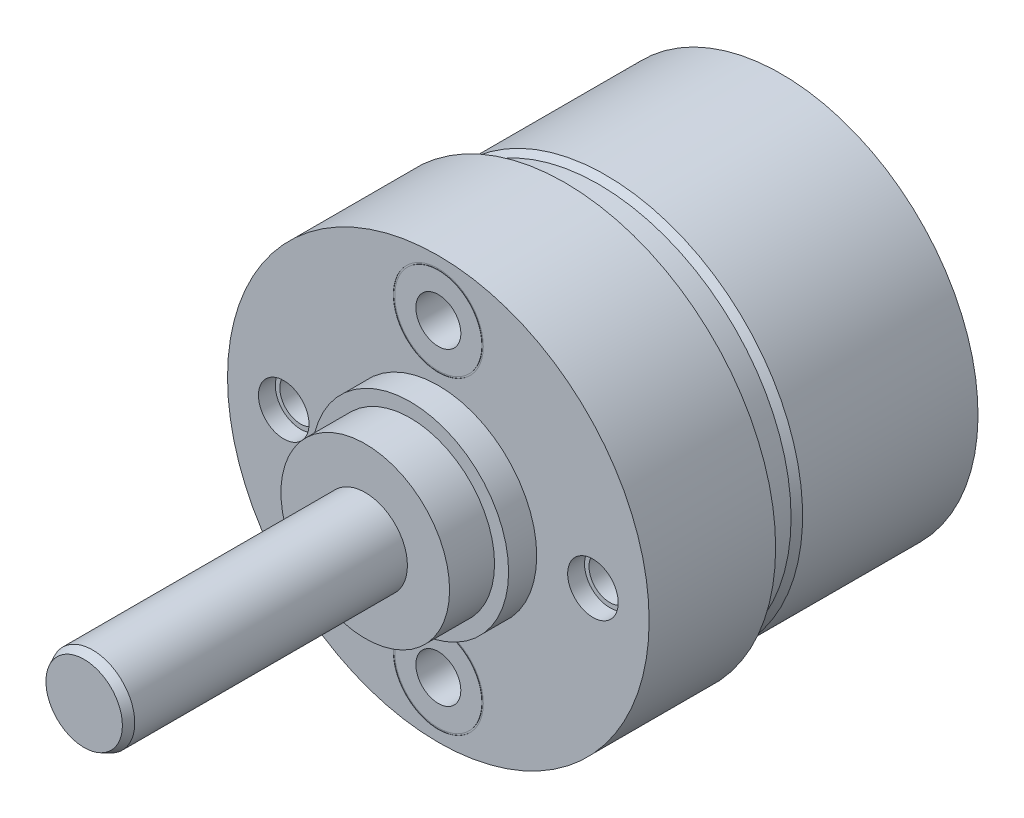
ISO-10303-21;
HEADER;
FILE_DESCRIPTION(('STEP AP214'),'2;1');
FILE_NAME('part.step','',(''),(''),'','','');
FILE_SCHEMA(('AUTOMOTIVE_DESIGN { 1 0 10303 214 1 1 1 1 }'));
ENDSEC;
DATA;
#1=APPLICATION_CONTEXT('core data for automotive mechanical design processes');
#2=APPLICATION_PROTOCOL_DEFINITION('international standard','automotive_design',2000,#1);
#3=PRODUCT_CONTEXT('',#1,'mechanical');
#4=PRODUCT('Part','Part','',(#3));
#5=PRODUCT_RELATED_PRODUCT_CATEGORY('part','',(#4));
#6=PRODUCT_DEFINITION_FORMATION('','',#4);
#7=PRODUCT_DEFINITION_CONTEXT('part definition',#1,'design');
#8=PRODUCT_DEFINITION('design','',#6,#7);
#9=PRODUCT_DEFINITION_SHAPE('','',#8);
#10=(LENGTH_UNIT() NAMED_UNIT(*) SI_UNIT(.MILLI.,.METRE.));
#11=(NAMED_UNIT(*) PLANE_ANGLE_UNIT() SI_UNIT($,.RADIAN.));
#12=(NAMED_UNIT(*) SI_UNIT($,.STERADIAN.) SOLID_ANGLE_UNIT());
#13=UNCERTAINTY_MEASURE_WITH_UNIT(LENGTH_MEASURE(1.E-05),#10,'distance_accuracy_value','');
#14=(GEOMETRIC_REPRESENTATION_CONTEXT(3) GLOBAL_UNCERTAINTY_ASSIGNED_CONTEXT((#13)) GLOBAL_UNIT_ASSIGNED_CONTEXT((#10,
#11,#12)) REPRESENTATION_CONTEXT('',''));
#15=CARTESIAN_POINT('',(0.,0.,0.));
#16=DIRECTION('',(0.,0.,1.));
#17=DIRECTION('',(1.,0.,0.));
#18=AXIS2_PLACEMENT_3D('',#15,#16,#17);
#19=CARTESIAN_POINT('',(0.,0.,-11.95));
#20=DIRECTION('',(0.,0.,1.));
#21=DIRECTION('',(1.,0.,0.));
#22=AXIS2_PLACEMENT_3D('',#19,#20,#21);
#23=PLANE('',#22);
#24=CARTESIAN_POINT('',(0.,0.,-11.95));
#25=DIRECTION('',(0.,0.,-1.));
#26=DIRECTION('',(1.,0.,0.));
#27=AXIS2_PLACEMENT_3D('',#24,#25,#26);
#28=CIRCLE('',#27,2.824);
#29=CARTESIAN_POINT('',(2.824,0.,-11.95));
#30=VERTEX_POINT('',#29);
#31=EDGE_CURVE('E180',#30,#30,#28,.T.);
#32=ORIENTED_EDGE('',*,*,#31,.T.);
#33=EDGE_LOOP('',(#32));
#34=FACE_BOUND('',#33,.T.);
#35=CARTESIAN_POINT('',(0.,0.,-11.95));
#36=DIRECTION('',(0.,0.,1.));
#37=DIRECTION('',(1.,0.,0.));
#38=AXIS2_PLACEMENT_3D('',#35,#36,#37);
#39=CIRCLE('',#38,2.724);
#40=CARTESIAN_POINT('',(2.724,0.,-11.95));
#41=VERTEX_POINT('',#40);
#42=EDGE_CURVE('E11',#41,#41,#39,.T.);
#43=ORIENTED_EDGE('',*,*,#42,.T.);
#44=EDGE_LOOP('',(#43));
#45=FACE_BOUND('',#44,.T.);
#46=ADVANCED_FACE('F16',(#34,#45),#23,.F.);
#47=CARTESIAN_POINT('',(0.,0.,-12.2));
#48=DIRECTION('',(0.,0.,1.));
#49=DIRECTION('',(1.,0.,0.));
#50=AXIS2_PLACEMENT_3D('',#47,#48,#49);
#51=CYLINDRICAL_SURFACE('',#50,2.724);
#52=ORIENTED_EDGE('',*,*,#42,.F.);
#53=EDGE_LOOP('',(#52));
#54=FACE_BOUND('',#53,.T.);
#55=CARTESIAN_POINT('',(0.,0.,-7.5));
#56=DIRECTION('',(0.,0.,1.));
#57=DIRECTION('',(1.,0.,0.));
#58=AXIS2_PLACEMENT_3D('',#55,#56,#57);
#59=CIRCLE('',#58,2.724);
#60=CARTESIAN_POINT('',(2.724,0.,-7.5));
#61=VERTEX_POINT('',#60);
#62=EDGE_CURVE('E27',#61,#61,#59,.T.);
#63=ORIENTED_EDGE('',*,*,#62,.T.);
#64=EDGE_LOOP('',(#63));
#65=FACE_BOUND('',#64,.T.);
#66=ADVANCED_FACE('F323',(#54,#65),#51,.F.);
#67=CARTESIAN_POINT('',(0.,0.,-7.5));
#68=DIRECTION('',(0.,0.,1.));
#69=DIRECTION('',(1.,0.,0.));
#70=AXIS2_PLACEMENT_3D('',#67,#68,#69);
#71=PLANE('',#70);
#72=ORIENTED_EDGE('',*,*,#62,.F.);
#73=EDGE_LOOP('',(#72));
#74=FACE_BOUND('',#73,.T.);
#75=ADVANCED_FACE('F328',(#74),#71,.F.);
#76=CARTESIAN_POINT('',(0.,0.,-12.15));
#77=DIRECTION('',(0.,0.,-1.));
#78=DIRECTION('',(0.,-1.,0.));
#79=AXIS2_PLACEMENT_3D('',#76,#77,#78);
#80=PLANE('',#79);
#81=CARTESIAN_POINT('',(0.,0.,-12.15));
#82=DIRECTION('',(0.,0.,-1.));
#83=DIRECTION('',(1.,0.,0.));
#84=AXIS2_PLACEMENT_3D('',#81,#82,#83);
#85=CIRCLE('',#84,2.824);
#86=CARTESIAN_POINT('',(2.824,0.,-12.15));
#87=VERTEX_POINT('',#86);
#88=EDGE_CURVE('E176',#87,#87,#85,.T.);
#89=ORIENTED_EDGE('',*,*,#88,.F.);
#90=EDGE_LOOP('',(#89));
#91=FACE_BOUND('',#90,.T.);
#92=CARTESIAN_POINT('',(0.,0.,-12.15));
#93=DIRECTION('',(0.,0.,-1.));
#94=DIRECTION('',(1.,0.,0.));
#95=AXIS2_PLACEMENT_3D('',#92,#93,#94);
#96=CIRCLE('',#95,6.);
#97=CARTESIAN_POINT('',(6.,0.,-12.15));
#98=VERTEX_POINT('',#97);
#99=EDGE_CURVE('E181',#98,#98,#96,.T.);
#100=ORIENTED_EDGE('',*,*,#99,.T.);
#101=EDGE_LOOP('',(#100));
#102=FACE_BOUND('',#101,.T.);
#103=ADVANCED_FACE('F375',(#91,#102),#80,.T.);
#104=CARTESIAN_POINT('',(0.,0.,-12.15));
#105=DIRECTION('',(0.,0.,1.));
#106=DIRECTION('',(1.,0.,0.));
#107=AXIS2_PLACEMENT_3D('',#104,#105,#106);
#108=CYLINDRICAL_SURFACE('',#107,2.824);
#109=ORIENTED_EDGE('',*,*,#31,.F.);
#110=EDGE_LOOP('',(#109));
#111=FACE_BOUND('',#110,.T.);
#112=ORIENTED_EDGE('',*,*,#88,.T.);
#113=EDGE_LOOP('',(#112));
#114=FACE_BOUND('',#113,.T.);
#115=ADVANCED_FACE('F177',(#111,#114),#108,.F.);
#116=CARTESIAN_POINT('',(0.,0.,-12.15));
#117=DIRECTION('',(0.,0.,1.));
#118=DIRECTION('',(1.,0.,0.));
#119=AXIS2_PLACEMENT_3D('',#116,#117,#118);
#120=CYLINDRICAL_SURFACE('',#119,6.);
#121=CARTESIAN_POINT('',(0.,0.,-11.95));
#122=DIRECTION('',(0.,0.,-1.));
#123=DIRECTION('',(1.,0.,0.));
#124=AXIS2_PLACEMENT_3D('',#121,#122,#123);
#125=CIRCLE('',#124,6.);
#126=CARTESIAN_POINT('',(6.,0.,-11.95));
#127=VERTEX_POINT('',#126);
#128=EDGE_CURVE('E221',#127,#127,#125,.T.);
#129=ORIENTED_EDGE('',*,*,#128,.T.);
#130=EDGE_LOOP('',(#129));
#131=FACE_BOUND('',#130,.T.);
#132=ORIENTED_EDGE('',*,*,#99,.F.);
#133=EDGE_LOOP('',(#132));
#134=FACE_BOUND('',#133,.T.);
#135=ADVANCED_FACE('F396',(#131,#134),#120,.T.);
#136=CARTESIAN_POINT('',(0.,0.,-12.2));
#137=DIRECTION('',(0.,0.,1.));
#138=DIRECTION('',(1.,0.,0.));
#139=AXIS2_PLACEMENT_3D('',#136,#137,#138);
#140=CYLINDRICAL_SURFACE('',#139,6.4);
#141=CARTESIAN_POINT('',(0.,0.,-12.2));
#142=DIRECTION('',(0.,0.,1.));
#143=DIRECTION('',(1.,0.,0.));
#144=AXIS2_PLACEMENT_3D('',#141,#142,#143);
#145=CIRCLE('',#144,6.4);
#146=CARTESIAN_POINT('',(-6.24829444556757,-1.38521352920386,-12.2));
#147=VERTEX_POINT('',#146);
#148=EDGE_CURVE('E234',#147,#147,#145,.T.);
#149=ORIENTED_EDGE('',*,*,#148,.F.);
#150=EDGE_LOOP('',(#149));
#151=FACE_BOUND('',#150,.T.);
#152=CARTESIAN_POINT('',(0.,0.,-11.95));
#153=DIRECTION('',(0.,0.,1.));
#154=DIRECTION('',(1.,0.,0.));
#155=AXIS2_PLACEMENT_3D('',#152,#153,#154);
#156=CIRCLE('',#155,6.4);
#157=CARTESIAN_POINT('',(6.4,0.,-11.95));
#158=VERTEX_POINT('',#157);
#159=EDGE_CURVE('E189',#158,#158,#156,.T.);
#160=ORIENTED_EDGE('',*,*,#159,.T.);
#161=EDGE_LOOP('',(#160));
#162=FACE_BOUND('',#161,.T.);
#163=ADVANCED_FACE('F392',(#151,#162),#140,.F.);
#164=CARTESIAN_POINT('',(0.,0.,-11.95));
#165=DIRECTION('',(0.,0.,1.));
#166=DIRECTION('',(1.,0.,0.));
#167=AXIS2_PLACEMENT_3D('',#164,#165,#166);
#168=PLANE('',#167);
#169=ORIENTED_EDGE('',*,*,#159,.F.);
#170=EDGE_LOOP('',(#169));
#171=FACE_BOUND('',#170,.T.);
#172=ORIENTED_EDGE('',*,*,#128,.F.);
#173=EDGE_LOOP('',(#172));
#174=FACE_BOUND('',#173,.T.);
#175=ADVANCED_FACE('F395',(#171,#174),#168,.F.);
#176=CARTESIAN_POINT('',(0.,0.,0.));
#177=DIRECTION('',(0.,0.,-1.));
#178=DIRECTION('',(-1.,0.,0.));
#179=AXIS2_PLACEMENT_3D('',#176,#177,#178);
#180=CYLINDRICAL_SURFACE('',#179,7.);
#181=CARTESIAN_POINT('',(0.,0.,-5.95980762113533));
#182=DIRECTION('',(0.,0.,-1.));
#183=DIRECTION('',(-1.,0.,0.));
#184=AXIS2_PLACEMENT_3D('',#181,#182,#183);
#185=CIRCLE('',#184,7.);
#186=CARTESIAN_POINT('',(-7.,0.,-5.95980762113533));
#187=VERTEX_POINT('',#186);
#188=EDGE_CURVE('E218',#187,#187,#185,.T.);
#189=ORIENTED_EDGE('',*,*,#188,.T.);
#190=EDGE_LOOP('',(#189));
#191=FACE_BOUND('',#190,.T.);
#192=CARTESIAN_POINT('',(0.,0.,-12.2));
#193=DIRECTION('',(0.,0.,-1.));
#194=DIRECTION('',(-1.,0.,0.));
#195=AXIS2_PLACEMENT_3D('',#192,#193,#194);
#196=CIRCLE('',#195,7.);
#197=CARTESIAN_POINT('',(-5.9037401206902,-3.76109725842777,-12.2));
#198=VERTEX_POINT('',#197);
#199=EDGE_CURVE('E193',#198,#198,#196,.T.);
#200=ORIENTED_EDGE('',*,*,#199,.F.);
#201=EDGE_LOOP('',(#200));
#202=FACE_BOUND('',#201,.T.);
#203=ADVANCED_FACE('F335',(#191,#202),#180,.T.);
#204=CARTESIAN_POINT('',(0.,0.,-5.7));
#205=DIRECTION('',(0.,0.,-1.));
#206=DIRECTION('',(-1.,0.,0.));
#207=AXIS2_PLACEMENT_3D('',#204,#205,#206);
#208=CONICAL_SURFACE('',#207,6.85,0.523598775);
#209=CARTESIAN_POINT('',(0.,0.,-5.7));
#210=DIRECTION('',(0.,0.,-1.));
#211=DIRECTION('',(-1.,0.,0.));
#212=AXIS2_PLACEMENT_3D('',#209,#210,#211);
#213=CIRCLE('',#212,6.85);
#214=CARTESIAN_POINT('',(-6.85,0.,-5.7));
#215=VERTEX_POINT('',#214);
#216=EDGE_CURVE('E211',#215,#215,#213,.T.);
#217=ORIENTED_EDGE('',*,*,#216,.T.);
#218=EDGE_LOOP('',(#217));
#219=FACE_BOUND('',#218,.T.);
#220=ORIENTED_EDGE('',*,*,#188,.F.);
#221=EDGE_LOOP('',(#220));
#222=FACE_BOUND('',#221,.T.);
#223=ADVANCED_FACE('F332',(#219,#222),#208,.T.);
#224=CARTESIAN_POINT('',(0.,0.,0.));
#225=DIRECTION('',(0.,0.,-1.));
#226=DIRECTION('',(-1.,0.,0.));
#227=AXIS2_PLACEMENT_3D('',#224,#225,#226);
#228=CYLINDRICAL_SURFACE('',#227,6.85);
#229=CARTESIAN_POINT('',(0.,0.,-4.5));
#230=DIRECTION('',(0.,0.,-1.));
#231=DIRECTION('',(-1.,0.,0.));
#232=AXIS2_PLACEMENT_3D('',#229,#230,#231);
#233=CIRCLE('',#232,6.85);
#234=CARTESIAN_POINT('',(-6.85,0.,-4.5));
#235=VERTEX_POINT('',#234);
#236=EDGE_CURVE('E208',#235,#235,#233,.T.);
#237=ORIENTED_EDGE('',*,*,#236,.T.);
#238=EDGE_LOOP('',(#237));
#239=FACE_BOUND('',#238,.T.);
#240=ORIENTED_EDGE('',*,*,#216,.F.);
#241=EDGE_LOOP('',(#240));
#242=FACE_BOUND('',#241,.T.);
#243=ADVANCED_FACE('F18',(#239,#242),#228,.T.);
#244=CARTESIAN_POINT('',(7.5,0.,-4.5));
#245=DIRECTION('',(0.,0.,1.));
#246=DIRECTION('',(1.,0.,0.));
#247=AXIS2_PLACEMENT_3D('',#244,#245,#246);
#248=PLANE('',#247);
#249=CARTESIAN_POINT('',(0.,0.,-4.5));
#250=DIRECTION('',(0.,0.,-1.));
#251=DIRECTION('',(-1.,0.,0.));
#252=AXIS2_PLACEMENT_3D('',#249,#250,#251);
#253=CIRCLE('',#252,7.5);
#254=CARTESIAN_POINT('',(-7.5,0.,-4.5));
#255=VERTEX_POINT('',#254);
#256=EDGE_CURVE('E245',#255,#255,#253,.T.);
#257=ORIENTED_EDGE('',*,*,#256,.T.);
#258=EDGE_LOOP('',(#257));
#259=FACE_BOUND('',#258,.T.);
#260=ORIENTED_EDGE('',*,*,#236,.F.);
#261=EDGE_LOOP('',(#260));
#262=FACE_BOUND('',#261,.T.);
#263=ADVANCED_FACE('F460',(#259,#262),#248,.F.);
#264=CARTESIAN_POINT('',(5.5,0.,0.));
#265=DIRECTION('',(0.,0.,-1.));
#266=DIRECTION('',(1.,0.,0.));
#267=AXIS2_PLACEMENT_3D('',#264,#265,#266);
#268=CYLINDRICAL_SURFACE('',#267,0.9);
#269=CARTESIAN_POINT('',(5.5,0.,0.));
#270=DIRECTION('',(0.,0.,-1.));
#271=DIRECTION('',(1.,0.,0.));
#272=AXIS2_PLACEMENT_3D('',#269,#270,#271);
#273=CIRCLE('',#272,0.9);
#274=CARTESIAN_POINT('',(6.4,0.,0.));
#275=VERTEX_POINT('',#274);
#276=EDGE_CURVE('E295',#275,#275,#273,.T.);
#277=ORIENTED_EDGE('',*,*,#276,.F.);
#278=EDGE_LOOP('',(#277));
#279=FACE_BOUND('',#278,.T.);
#280=CARTESIAN_POINT('',(5.5,0.,-0.6));
#281=DIRECTION('',(0.,0.,-1.));
#282=DIRECTION('',(1.,0.,0.));
#283=AXIS2_PLACEMENT_3D('',#280,#281,#282);
#284=CIRCLE('',#283,0.9);
#285=CARTESIAN_POINT('',(6.4,0.,-0.6));
#286=VERTEX_POINT('',#285);
#287=EDGE_CURVE('E212',#286,#286,#284,.T.);
#288=ORIENTED_EDGE('',*,*,#287,.T.);
#289=EDGE_LOOP('',(#288));
#290=FACE_BOUND('',#289,.T.);
#291=ADVANCED_FACE('F360',(#279,#290),#268,.F.);
#292=CARTESIAN_POINT('',(5.5,0.,-0.6));
#293=DIRECTION('',(0.,0.,-1.));
#294=DIRECTION('',(0.,-1.,0.));
#295=AXIS2_PLACEMENT_3D('',#292,#293,#294);
#296=PLANE('',#295);
#297=ORIENTED_EDGE('',*,*,#287,.F.);
#298=EDGE_LOOP('',(#297));
#299=FACE_BOUND('',#298,.T.);
#300=CARTESIAN_POINT('',(5.5,0.,-0.6));
#301=DIRECTION('',(0.,0.,-1.));
#302=DIRECTION('',(1.,0.,0.));
#303=AXIS2_PLACEMENT_3D('',#300,#301,#302);
#304=CIRCLE('',#303,0.74);
#305=CARTESIAN_POINT('',(6.24,0.,-0.6));
#306=VERTEX_POINT('',#305);
#307=EDGE_CURVE('E206',#306,#306,#304,.T.);
#308=ORIENTED_EDGE('',*,*,#307,.T.);
#309=EDGE_LOOP('',(#308));
#310=FACE_BOUND('',#309,.T.);
#311=ADVANCED_FACE('F353',(#299,#310),#296,.F.);
#312=CARTESIAN_POINT('',(5.5,0.,-4.));
#313=DIRECTION('',(0.,0.,-1.));
#314=DIRECTION('',(1.,0.,0.));
#315=AXIS2_PLACEMENT_3D('',#312,#313,#314);
#316=CYLINDRICAL_SURFACE('',#315,0.74);
#317=ORIENTED_EDGE('',*,*,#307,.F.);
#318=EDGE_LOOP('',(#317));
#319=FACE_BOUND('',#318,.T.);
#320=CARTESIAN_POINT('',(5.5,0.,-4.));
#321=DIRECTION('',(0.,0.,-1.));
#322=DIRECTION('',(1.,0.,0.));
#323=AXIS2_PLACEMENT_3D('',#320,#321,#322);
#324=CIRCLE('',#323,0.74);
#325=CARTESIAN_POINT('',(6.24,0.,-4.));
#326=VERTEX_POINT('',#325);
#327=EDGE_CURVE('E203',#326,#326,#324,.T.);
#328=ORIENTED_EDGE('',*,*,#327,.T.);
#329=EDGE_LOOP('',(#328));
#330=FACE_BOUND('',#329,.T.);
#331=ADVANCED_FACE('F344',(#319,#330),#316,.F.);
#332=CARTESIAN_POINT('',(5.5,0.,-4.));
#333=DIRECTION('',(0.,0.,-1.));
#334=DIRECTION('',(0.,-1.,0.));
#335=AXIS2_PLACEMENT_3D('',#332,#333,#334);
#336=PLANE('',#335);
#337=ORIENTED_EDGE('',*,*,#327,.F.);
#338=EDGE_LOOP('',(#337));
#339=FACE_BOUND('',#338,.T.);
#340=ADVANCED_FACE('F341',(#339),#336,.F.);
#341=CARTESIAN_POINT('',(-5.5,0.,0.));
#342=DIRECTION('',(0.,0.,-1.));
#343=DIRECTION('',(-1.,0.,0.));
#344=AXIS2_PLACEMENT_3D('',#341,#342,#343);
#345=CYLINDRICAL_SURFACE('',#344,0.9);
#346=CARTESIAN_POINT('',(-5.5,0.,0.));
#347=DIRECTION('',(0.,0.,-1.));
#348=DIRECTION('',(-1.,0.,0.));
#349=AXIS2_PLACEMENT_3D('',#346,#347,#348);
#350=CIRCLE('',#349,0.9);
#351=CARTESIAN_POINT('',(-6.4,0.,0.));
#352=VERTEX_POINT('',#351);
#353=EDGE_CURVE('E217',#352,#352,#350,.T.);
#354=ORIENTED_EDGE('',*,*,#353,.F.);
#355=EDGE_LOOP('',(#354));
#356=FACE_BOUND('',#355,.T.);
#357=CARTESIAN_POINT('',(-5.5,0.,-0.6));
#358=DIRECTION('',(0.,0.,-1.));
#359=DIRECTION('',(-1.,0.,0.));
#360=AXIS2_PLACEMENT_3D('',#357,#358,#359);
#361=CIRCLE('',#360,0.9);
#362=CARTESIAN_POINT('',(-6.4,0.,-0.6));
#363=VERTEX_POINT('',#362);
#364=EDGE_CURVE('E207',#363,#363,#361,.T.);
#365=ORIENTED_EDGE('',*,*,#364,.T.);
#366=EDGE_LOOP('',(#365));
#367=FACE_BOUND('',#366,.T.);
#368=ADVANCED_FACE('F343',(#356,#367),#345,.F.);
#369=CARTESIAN_POINT('',(-5.5,0.,-0.6));
#370=DIRECTION('',(0.,0.,-1.));
#371=DIRECTION('',(0.,-1.,0.));
#372=AXIS2_PLACEMENT_3D('',#369,#370,#371);
#373=PLANE('',#372);
#374=ORIENTED_EDGE('',*,*,#364,.F.);
#375=EDGE_LOOP('',(#374));
#376=FACE_BOUND('',#375,.T.);
#377=CARTESIAN_POINT('',(-5.5,0.,-0.6));
#378=DIRECTION('',(0.,0.,-1.));
#379=DIRECTION('',(-1.,0.,0.));
#380=AXIS2_PLACEMENT_3D('',#377,#378,#379);
#381=CIRCLE('',#380,0.74);
#382=CARTESIAN_POINT('',(-6.24,0.,-0.6));
#383=VERTEX_POINT('',#382);
#384=EDGE_CURVE('E201',#383,#383,#381,.T.);
#385=ORIENTED_EDGE('',*,*,#384,.T.);
#386=EDGE_LOOP('',(#385));
#387=FACE_BOUND('',#386,.T.);
#388=ADVANCED_FACE('F350',(#376,#387),#373,.F.);
#389=CARTESIAN_POINT('',(-5.5,0.,-4.));
#390=DIRECTION('',(0.,0.,-1.));
#391=DIRECTION('',(-1.,0.,0.));
#392=AXIS2_PLACEMENT_3D('',#389,#390,#391);
#393=CYLINDRICAL_SURFACE('',#392,0.74);
#394=ORIENTED_EDGE('',*,*,#384,.F.);
#395=EDGE_LOOP('',(#394));
#396=FACE_BOUND('',#395,.T.);
#397=CARTESIAN_POINT('',(-5.5,0.,-4.));
#398=DIRECTION('',(0.,0.,-1.));
#399=DIRECTION('',(-1.,0.,0.));
#400=AXIS2_PLACEMENT_3D('',#397,#398,#399);
#401=CIRCLE('',#400,0.74);
#402=CARTESIAN_POINT('',(-6.24,0.,-4.));
#403=VERTEX_POINT('',#402);
#404=EDGE_CURVE('E197',#403,#403,#401,.T.);
#405=ORIENTED_EDGE('',*,*,#404,.T.);
#406=EDGE_LOOP('',(#405));
#407=FACE_BOUND('',#406,.T.);
#408=ADVANCED_FACE('F429',(#396,#407),#393,.F.);
#409=CARTESIAN_POINT('',(-5.5,0.,-4.));
#410=DIRECTION('',(0.,0.,-1.));
#411=DIRECTION('',(0.,-1.,0.));
#412=AXIS2_PLACEMENT_3D('',#409,#410,#411);
#413=PLANE('',#412);
#414=ORIENTED_EDGE('',*,*,#404,.F.);
#415=EDGE_LOOP('',(#414));
#416=FACE_BOUND('',#415,.T.);
#417=ADVANCED_FACE('F432',(#416),#413,.F.);
#418=CARTESIAN_POINT('',(0.,0.,0.));
#419=DIRECTION('',(0.,0.,1.));
#420=DIRECTION('',(1.,0.,0.));
#421=AXIS2_PLACEMENT_3D('',#418,#419,#420);
#422=PLANE('',#421);
#423=CARTESIAN_POINT('',(0.,-5.5,0.));
#424=DIRECTION('',(0.,0.,-1.));
#425=DIRECTION('',(1.,0.,0.));
#426=AXIS2_PLACEMENT_3D('',#423,#424,#425);
#427=CIRCLE('',#426,0.8);
#428=CARTESIAN_POINT('',(0.8,-5.5,0.));
#429=VERTEX_POINT('',#428);
#430=EDGE_CURVE('E202',#429,#429,#427,.T.);
#431=ORIENTED_EDGE('',*,*,#430,.T.);
#432=EDGE_LOOP('',(#431));
#433=FACE_BOUND('',#432,.T.);
#434=CARTESIAN_POINT('',(0.,-5.5,0.));
#435=DIRECTION('',(0.,0.,-1.));
#436=DIRECTION('',(1.,0.,0.));
#437=AXIS2_PLACEMENT_3D('',#434,#435,#436);
#438=CIRCLE('',#437,1.55);
#439=CARTESIAN_POINT('',(1.55,-5.5,0.));
#440=VERTEX_POINT('',#439);
#441=EDGE_CURVE('E222',#440,#440,#438,.T.);
#442=ORIENTED_EDGE('',*,*,#441,.F.);
#443=EDGE_LOOP('',(#442));
#444=FACE_BOUND('',#443,.T.);
#445=ADVANCED_FACE('F417',(#433,#444),#422,.T.);
#446=CARTESIAN_POINT('',(0.,-5.5,0.));
#447=DIRECTION('',(0.,0.,-1.));
#448=DIRECTION('',(1.,0.,0.));
#449=AXIS2_PLACEMENT_3D('',#446,#447,#448);
#450=CYLINDRICAL_SURFACE('',#449,0.8);
#451=ORIENTED_EDGE('',*,*,#430,.F.);
#452=EDGE_LOOP('',(#451));
#453=FACE_BOUND('',#452,.T.);
#454=CARTESIAN_POINT('',(0.,-5.5,-4.));
#455=DIRECTION('',(0.,0.,-1.));
#456=DIRECTION('',(1.,0.,0.));
#457=AXIS2_PLACEMENT_3D('',#454,#455,#456);
#458=CIRCLE('',#457,0.8);
#459=CARTESIAN_POINT('',(0.8,-5.5,-4.));
#460=VERTEX_POINT('',#459);
#461=EDGE_CURVE('E226',#460,#460,#458,.T.);
#462=ORIENTED_EDGE('',*,*,#461,.T.);
#463=EDGE_LOOP('',(#462));
#464=FACE_BOUND('',#463,.T.);
#465=ADVANCED_FACE('F413',(#453,#464),#450,.F.);
#466=CARTESIAN_POINT('',(0.,-5.5,-4.));
#467=DIRECTION('',(0.,0.,-1.));
#468=DIRECTION('',(0.,-1.,0.));
#469=AXIS2_PLACEMENT_3D('',#466,#467,#468);
#470=PLANE('',#469);
#471=ORIENTED_EDGE('',*,*,#461,.F.);
#472=EDGE_LOOP('',(#471));
#473=FACE_BOUND('',#472,.T.);
#474=ADVANCED_FACE('F416',(#473),#470,.F.);
#475=CARTESIAN_POINT('',(0.,-5.5,-0.01));
#476=DIRECTION('',(0.,0.,-1.));
#477=DIRECTION('',(0.,-1.,0.));
#478=AXIS2_PLACEMENT_3D('',#475,#476,#477);
#479=PLANE('',#478);
#480=CARTESIAN_POINT('',(0.,-5.5,-0.01));
#481=DIRECTION('',(0.,0.,1.));
#482=DIRECTION('',(1.,0.,0.));
#483=AXIS2_PLACEMENT_3D('',#480,#481,#482);
#484=CIRCLE('',#483,1.55);
#485=CARTESIAN_POINT('',(1.55,-5.5,-0.01));
#486=VERTEX_POINT('',#485);
#487=EDGE_CURVE('E227',#486,#486,#484,.T.);
#488=ORIENTED_EDGE('',*,*,#487,.F.);
#489=EDGE_LOOP('',(#488));
#490=FACE_BOUND('',#489,.T.);
#491=CARTESIAN_POINT('',(0.,-5.5,-0.01));
#492=DIRECTION('',(0.,0.,1.));
#493=DIRECTION('',(1.,0.,0.));
#494=AXIS2_PLACEMENT_3D('',#491,#492,#493);
#495=CIRCLE('',#494,1.6);
#496=CARTESIAN_POINT('',(1.6,-5.5,-0.01));
#497=VERTEX_POINT('',#496);
#498=EDGE_CURVE('E271',#497,#497,#495,.T.);
#499=ORIENTED_EDGE('',*,*,#498,.T.);
#500=EDGE_LOOP('',(#499));
#501=FACE_BOUND('',#500,.T.);
#502=ADVANCED_FACE('F422',(#490,#501),#479,.F.);
#503=CARTESIAN_POINT('',(0.,-5.5,-0.01));
#504=DIRECTION('',(0.,0.,1.));
#505=DIRECTION('',(1.,0.,0.));
#506=AXIS2_PLACEMENT_3D('',#503,#504,#505);
#507=CYLINDRICAL_SURFACE('',#506,1.55);
#508=ORIENTED_EDGE('',*,*,#441,.T.);
#509=EDGE_LOOP('',(#508));
#510=FACE_BOUND('',#509,.T.);
#511=ORIENTED_EDGE('',*,*,#487,.T.);
#512=EDGE_LOOP('',(#511));
#513=FACE_BOUND('',#512,.T.);
#514=ADVANCED_FACE('F368',(#510,#513),#507,.T.);
#515=CARTESIAN_POINT('',(0.,-5.5,-0.01));
#516=DIRECTION('',(0.,0.,1.));
#517=DIRECTION('',(1.,0.,0.));
#518=AXIS2_PLACEMENT_3D('',#515,#516,#517);
#519=CYLINDRICAL_SURFACE('',#518,1.6);
#520=CARTESIAN_POINT('',(0.,-5.5,0.));
#521=DIRECTION('',(0.,0.,-1.));
#522=DIRECTION('',(1.,0.,0.));
#523=AXIS2_PLACEMENT_3D('',#520,#521,#522);
#524=CIRCLE('',#523,1.6);
#525=CARTESIAN_POINT('',(1.6,-5.5,0.));
#526=VERTEX_POINT('',#525);
#527=EDGE_CURVE('E233',#526,#526,#524,.T.);
#528=ORIENTED_EDGE('',*,*,#527,.F.);
#529=EDGE_LOOP('',(#528));
#530=FACE_BOUND('',#529,.T.);
#531=ORIENTED_EDGE('',*,*,#498,.F.);
#532=EDGE_LOOP('',(#531));
#533=FACE_BOUND('',#532,.T.);
#534=ADVANCED_FACE('F365',(#530,#533),#519,.F.);
#535=CARTESIAN_POINT('',(0.,0.,0.));
#536=DIRECTION('',(0.,0.,1.));
#537=DIRECTION('',(1.,0.,0.));
#538=AXIS2_PLACEMENT_3D('',#535,#536,#537);
#539=PLANE('',#538);
#540=CARTESIAN_POINT('',(0.,5.5,0.));
#541=DIRECTION('',(0.,0.,1.));
#542=DIRECTION('',(1.,0.,0.));
#543=AXIS2_PLACEMENT_3D('',#540,#541,#542);
#544=CIRCLE('',#543,1.55);
#545=CARTESIAN_POINT('',(1.55,5.5,0.));
#546=VERTEX_POINT('',#545);
#547=EDGE_CURVE('E257',#546,#546,#544,.T.);
#548=ORIENTED_EDGE('',*,*,#547,.T.);
#549=EDGE_LOOP('',(#548));
#550=FACE_BOUND('',#549,.T.);
#551=CARTESIAN_POINT('',(0.,5.5,0.));
#552=DIRECTION('',(0.,0.,-1.));
#553=DIRECTION('',(-1.,0.,0.));
#554=AXIS2_PLACEMENT_3D('',#551,#552,#553);
#555=CIRCLE('',#554,0.8);
#556=CARTESIAN_POINT('',(-0.8,5.5,0.));
#557=VERTEX_POINT('',#556);
#558=EDGE_CURVE('E265',#557,#557,#555,.T.);
#559=ORIENTED_EDGE('',*,*,#558,.T.);
#560=EDGE_LOOP('',(#559));
#561=FACE_BOUND('',#560,.T.);
#562=ADVANCED_FACE('F367',(#550,#561),#539,.T.);
#563=CARTESIAN_POINT('',(0.,5.5,0.));
#564=DIRECTION('',(0.,0.,-1.));
#565=DIRECTION('',(-1.,0.,0.));
#566=AXIS2_PLACEMENT_3D('',#563,#564,#565);
#567=CYLINDRICAL_SURFACE('',#566,0.8);
#568=ORIENTED_EDGE('',*,*,#558,.F.);
#569=EDGE_LOOP('',(#568));
#570=FACE_BOUND('',#569,.T.);
#571=CARTESIAN_POINT('',(0.,5.5,-4.));
#572=DIRECTION('',(0.,0.,-1.));
#573=DIRECTION('',(-1.,0.,0.));
#574=AXIS2_PLACEMENT_3D('',#571,#572,#573);
#575=CIRCLE('',#574,0.8);
#576=CARTESIAN_POINT('',(-0.8,5.5,-4.));
#577=VERTEX_POINT('',#576);
#578=EDGE_CURVE('E260',#577,#577,#575,.T.);
#579=ORIENTED_EDGE('',*,*,#578,.T.);
#580=EDGE_LOOP('',(#579));
#581=FACE_BOUND('',#580,.T.);
#582=ADVANCED_FACE('F373',(#570,#581),#567,.F.);
#583=CARTESIAN_POINT('',(0.,5.5,-4.));
#584=DIRECTION('',(0.,0.,-1.));
#585=DIRECTION('',(0.,-1.,0.));
#586=AXIS2_PLACEMENT_3D('',#583,#584,#585);
#587=PLANE('',#586);
#588=ORIENTED_EDGE('',*,*,#578,.F.);
#589=EDGE_LOOP('',(#588));
#590=FACE_BOUND('',#589,.T.);
#591=ADVANCED_FACE('F390',(#590),#587,.F.);
#592=CARTESIAN_POINT('',(0.,5.5,-0.01));
#593=DIRECTION('',(0.,0.,1.));
#594=DIRECTION('',(1.,0.,0.));
#595=AXIS2_PLACEMENT_3D('',#592,#593,#594);
#596=PLANE('',#595);
#597=CARTESIAN_POINT('',(0.,5.5,-0.01));
#598=DIRECTION('',(0.,0.,-1.));
#599=DIRECTION('',(1.,0.,0.));
#600=AXIS2_PLACEMENT_3D('',#597,#598,#599);
#601=CIRCLE('',#600,1.55);
#602=CARTESIAN_POINT('',(1.55,5.5,-0.01));
#603=VERTEX_POINT('',#602);
#604=EDGE_CURVE('E261',#603,#603,#601,.T.);
#605=ORIENTED_EDGE('',*,*,#604,.T.);
#606=EDGE_LOOP('',(#605));
#607=FACE_BOUND('',#606,.T.);
#608=CARTESIAN_POINT('',(0.,5.5,-0.01));
#609=DIRECTION('',(0.,0.,-1.));
#610=DIRECTION('',(1.,0.,0.));
#611=AXIS2_PLACEMENT_3D('',#608,#609,#610);
#612=CIRCLE('',#611,1.6);
#613=CARTESIAN_POINT('',(1.6,5.5,-0.01));
#614=VERTEX_POINT('',#613);
#615=EDGE_CURVE('E256',#614,#614,#612,.T.);
#616=ORIENTED_EDGE('',*,*,#615,.F.);
#617=EDGE_LOOP('',(#616));
#618=FACE_BOUND('',#617,.T.);
#619=ADVANCED_FACE('F387',(#607,#618),#596,.T.);
#620=CARTESIAN_POINT('',(0.,5.5,-0.01));
#621=DIRECTION('',(0.,0.,1.));
#622=DIRECTION('',(1.,0.,0.));
#623=AXIS2_PLACEMENT_3D('',#620,#621,#622);
#624=CYLINDRICAL_SURFACE('',#623,1.55);
#625=ORIENTED_EDGE('',*,*,#547,.F.);
#626=EDGE_LOOP('',(#625));
#627=FACE_BOUND('',#626,.T.);
#628=ORIENTED_EDGE('',*,*,#604,.F.);
#629=EDGE_LOOP('',(#628));
#630=FACE_BOUND('',#629,.T.);
#631=ADVANCED_FACE('F385',(#627,#630),#624,.T.);
#632=CARTESIAN_POINT('',(0.,5.5,-0.01));
#633=DIRECTION('',(0.,0.,1.));
#634=DIRECTION('',(1.,0.,0.));
#635=AXIS2_PLACEMENT_3D('',#632,#633,#634);
#636=CYLINDRICAL_SURFACE('',#635,1.6);
#637=CARTESIAN_POINT('',(0.,5.5,0.));
#638=DIRECTION('',(0.,0.,1.));
#639=DIRECTION('',(1.,0.,0.));
#640=AXIS2_PLACEMENT_3D('',#637,#638,#639);
#641=CIRCLE('',#640,1.6);
#642=CARTESIAN_POINT('',(1.6,5.5,0.));
#643=VERTEX_POINT('',#642);
#644=EDGE_CURVE('E213',#643,#643,#641,.T.);
#645=ORIENTED_EDGE('',*,*,#644,.T.);
#646=EDGE_LOOP('',(#645));
#647=FACE_BOUND('',#646,.T.);
#648=ORIENTED_EDGE('',*,*,#615,.T.);
#649=EDGE_LOOP('',(#648));
#650=FACE_BOUND('',#649,.T.);
#651=ADVANCED_FACE('F381',(#647,#650),#636,.F.);
#652=CARTESIAN_POINT('',(0.,0.,12.6));
#653=DIRECTION('',(0.,0.,-1.));
#654=DIRECTION('',(-1.,0.,0.));
#655=AXIS2_PLACEMENT_3D('',#652,#653,#654);
#656=CONICAL_SURFACE('',#655,1.3601077025535,0.4363323125);
#657=CARTESIAN_POINT('',(0.,0.,12.6));
#658=DIRECTION('',(0.,0.,1.));
#659=DIRECTION('',(1.,0.,0.));
#660=AXIS2_PLACEMENT_3D('',#657,#658,#659);
#661=CIRCLE('',#660,1.3601077025535);
#662=CARTESIAN_POINT('',(1.3601077025535,0.,12.6));
#663=VERTEX_POINT('',#662);
#664=EDGE_CURVE('E252',#663,#663,#661,.T.);
#665=ORIENTED_EDGE('',*,*,#664,.F.);
#666=EDGE_LOOP('',(#665));
#667=FACE_BOUND('',#666,.T.);
#668=CARTESIAN_POINT('',(0.,0.,12.3));
#669=DIRECTION('',(0.,0.,-1.));
#670=DIRECTION('',(1.,0.,0.));
#671=AXIS2_PLACEMENT_3D('',#668,#669,#670);
#672=CIRCLE('',#671,1.5);
#673=CARTESIAN_POINT('',(1.5,0.,12.3));
#674=VERTEX_POINT('',#673);
#675=EDGE_CURVE('E248',#674,#674,#672,.T.);
#676=ORIENTED_EDGE('',*,*,#675,.F.);
#677=EDGE_LOOP('',(#676));
#678=FACE_BOUND('',#677,.T.);
#679=ADVANCED_FACE('F384',(#667,#678),#656,.T.);
#680=CARTESIAN_POINT('',(0.,0.,12.6));
#681=DIRECTION('',(0.,0.,1.));
#682=DIRECTION('',(1.,0.,0.));
#683=AXIS2_PLACEMENT_3D('',#680,#681,#682);
#684=PLANE('',#683);
#685=ORIENTED_EDGE('',*,*,#664,.T.);
#686=EDGE_LOOP('',(#685));
#687=FACE_BOUND('',#686,.T.);
#688=ADVANCED_FACE('F405',(#687),#684,.T.);
#689=CARTESIAN_POINT('',(0.,0.,12.6));
#690=DIRECTION('',(0.,0.,-1.));
#691=DIRECTION('',(-1.,0.,0.));
#692=AXIS2_PLACEMENT_3D('',#689,#690,#691);
#693=CYLINDRICAL_SURFACE('',#692,1.5);
#694=CARTESIAN_POINT('',(0.,0.,2.6));
#695=DIRECTION('',(0.,0.,-1.));
#696=DIRECTION('',(1.,0.,0.));
#697=AXIS2_PLACEMENT_3D('',#694,#695,#696);
#698=CIRCLE('',#697,1.5);
#699=CARTESIAN_POINT('',(1.5,0.,2.6));
#700=VERTEX_POINT('',#699);
#701=EDGE_CURVE('E242',#700,#700,#698,.T.);
#702=ORIENTED_EDGE('',*,*,#701,.F.);
#703=EDGE_LOOP('',(#702));
#704=FACE_BOUND('',#703,.T.);
#705=ORIENTED_EDGE('',*,*,#675,.T.);
#706=EDGE_LOOP('',(#705));
#707=FACE_BOUND('',#706,.T.);
#708=ADVANCED_FACE('F408',(#704,#707),#693,.T.);
#709=CARTESIAN_POINT('',(0.,0.,0.));
#710=DIRECTION('',(0.,0.,1.));
#711=DIRECTION('',(1.,0.,0.));
#712=AXIS2_PLACEMENT_3D('',#709,#710,#711);
#713=CYLINDRICAL_SURFACE('',#712,3.);
#714=CARTESIAN_POINT('',(0.,0.,2.6));
#715=DIRECTION('',(0.,0.,1.));
#716=DIRECTION('',(1.,0.,0.));
#717=AXIS2_PLACEMENT_3D('',#714,#715,#716);
#718=CIRCLE('',#717,3.);
#719=CARTESIAN_POINT('',(3.,0.,2.6));
#720=VERTEX_POINT('',#719);
#721=EDGE_CURVE('E20',#720,#720,#718,.T.);
#722=ORIENTED_EDGE('',*,*,#721,.F.);
#723=EDGE_LOOP('',(#722));
#724=FACE_BOUND('',#723,.T.);
#725=CARTESIAN_POINT('',(0.,0.,1.));
#726=DIRECTION('',(0.,0.,1.));
#727=DIRECTION('',(1.,0.,0.));
#728=AXIS2_PLACEMENT_3D('',#725,#726,#727);
#729=CIRCLE('',#728,3.);
#730=CARTESIAN_POINT('',(3.,0.,1.));
#731=VERTEX_POINT('',#730);
#732=EDGE_CURVE('E284',#731,#731,#729,.T.);
#733=ORIENTED_EDGE('',*,*,#732,.T.);
#734=EDGE_LOOP('',(#733));
#735=FACE_BOUND('',#734,.T.);
#736=ADVANCED_FACE('F301',(#724,#735),#713,.T.);
#737=CARTESIAN_POINT('',(0.,0.,0.));
#738=DIRECTION('',(0.,0.,1.));
#739=DIRECTION('',(1.,0.,0.));
#740=AXIS2_PLACEMENT_3D('',#737,#738,#739);
#741=CYLINDRICAL_SURFACE('',#740,3.5);
#742=CARTESIAN_POINT('',(0.,0.,0.));
#743=DIRECTION('',(0.,0.,1.));
#744=DIRECTION('',(1.,0.,0.));
#745=AXIS2_PLACEMENT_3D('',#742,#743,#744);
#746=CIRCLE('',#745,3.5);
#747=CARTESIAN_POINT('',(3.5,0.,0.));
#748=VERTEX_POINT('',#747);
#749=EDGE_CURVE('E216',#748,#748,#746,.T.);
#750=ORIENTED_EDGE('',*,*,#749,.T.);
#751=EDGE_LOOP('',(#750));
#752=FACE_BOUND('',#751,.T.);
#753=CARTESIAN_POINT('',(0.,0.,1.));
#754=DIRECTION('',(0.,0.,-1.));
#755=DIRECTION('',(-1.,0.,0.));
#756=AXIS2_PLACEMENT_3D('',#753,#754,#755);
#757=CIRCLE('',#756,3.5);
#758=CARTESIAN_POINT('',(-3.5,0.,1.));
#759=VERTEX_POINT('',#758);
#760=EDGE_CURVE('E253',#759,#759,#757,.T.);
#761=ORIENTED_EDGE('',*,*,#760,.T.);
#762=EDGE_LOOP('',(#761));
#763=FACE_BOUND('',#762,.T.);
#764=ADVANCED_FACE('F306',(#752,#763),#741,.T.);
#765=CARTESIAN_POINT('',(0.,0.,1.));
#766=DIRECTION('',(0.,0.,1.));
#767=DIRECTION('',(1.,0.,0.));
#768=AXIS2_PLACEMENT_3D('',#765,#766,#767);
#769=PLANE('',#768);
#770=ORIENTED_EDGE('',*,*,#760,.F.);
#771=EDGE_LOOP('',(#770));
#772=FACE_BOUND('',#771,.T.);
#773=ORIENTED_EDGE('',*,*,#732,.F.);
#774=EDGE_LOOP('',(#773));
#775=FACE_BOUND('',#774,.T.);
#776=ADVANCED_FACE('F303',(#772,#775),#769,.T.);
#777=CARTESIAN_POINT('',(0.,0.,0.));
#778=DIRECTION('',(0.,0.,-1.));
#779=DIRECTION('',(-1.,0.,0.));
#780=AXIS2_PLACEMENT_3D('',#777,#778,#779);
#781=CYLINDRICAL_SURFACE('',#780,7.5);
#782=CARTESIAN_POINT('',(0.,0.,0.));
#783=DIRECTION('',(0.,0.,-1.));
#784=DIRECTION('',(-1.,0.,0.));
#785=AXIS2_PLACEMENT_3D('',#782,#783,#784);
#786=CIRCLE('',#785,7.5);
#787=CARTESIAN_POINT('',(-7.5,0.,0.));
#788=VERTEX_POINT('',#787);
#789=EDGE_CURVE('E230',#788,#788,#786,.T.);
#790=ORIENTED_EDGE('',*,*,#789,.T.);
#791=EDGE_LOOP('',(#790));
#792=FACE_BOUND('',#791,.T.);
#793=ORIENTED_EDGE('',*,*,#256,.F.);
#794=EDGE_LOOP('',(#793));
#795=FACE_BOUND('',#794,.T.);
#796=ADVANCED_FACE('F305',(#792,#795),#781,.T.);
#797=CARTESIAN_POINT('',(0.,0.,2.6));
#798=DIRECTION('',(0.,0.,1.));
#799=DIRECTION('',(1.,0.,0.));
#800=AXIS2_PLACEMENT_3D('',#797,#798,#799);
#801=PLANE('',#800);
#802=ORIENTED_EDGE('',*,*,#701,.T.);
#803=EDGE_LOOP('',(#802));
#804=FACE_BOUND('',#803,.T.);
#805=ORIENTED_EDGE('',*,*,#721,.T.);
#806=EDGE_LOOP('',(#805));
#807=FACE_BOUND('',#806,.T.);
#808=ADVANCED_FACE('F314',(#804,#807),#801,.T.);
#809=CARTESIAN_POINT('',(0.,0.,0.));
#810=DIRECTION('',(0.,0.,1.));
#811=DIRECTION('',(1.,0.,0.));
#812=AXIS2_PLACEMENT_3D('',#809,#810,#811);
#813=PLANE('',#812);
#814=ORIENTED_EDGE('',*,*,#527,.T.);
#815=EDGE_LOOP('',(#814));
#816=FACE_BOUND('',#815,.T.);
#817=ORIENTED_EDGE('',*,*,#789,.F.);
#818=EDGE_LOOP('',(#817));
#819=FACE_BOUND('',#818,.T.);
#820=ORIENTED_EDGE('',*,*,#749,.F.);
#821=EDGE_LOOP('',(#820));
#822=FACE_BOUND('',#821,.T.);
#823=ORIENTED_EDGE('',*,*,#644,.F.);
#824=EDGE_LOOP('',(#823));
#825=FACE_BOUND('',#824,.T.);
#826=ORIENTED_EDGE('',*,*,#353,.T.);
#827=EDGE_LOOP('',(#826));
#828=FACE_BOUND('',#827,.T.);
#829=ORIENTED_EDGE('',*,*,#276,.T.);
#830=EDGE_LOOP('',(#829));
#831=FACE_BOUND('',#830,.T.);
#832=ADVANCED_FACE('F339',(#816,#819,#822,#825,#828,#831),#813,.T.);
#833=CARTESIAN_POINT('',(0.,0.,-12.2));
#834=DIRECTION('',(0.,0.,-1.));
#835=DIRECTION('',(0.,-1.,0.));
#836=AXIS2_PLACEMENT_3D('',#833,#834,#835);
#837=PLANE('',#836);
#838=ORIENTED_EDGE('',*,*,#199,.T.);
#839=EDGE_LOOP('',(#838));
#840=FACE_BOUND('',#839,.T.);
#841=ORIENTED_EDGE('',*,*,#148,.T.);
#842=EDGE_LOOP('',(#841));
#843=FACE_BOUND('',#842,.T.);
#844=ADVANCED_FACE('F401',(#840,#843),#837,.T.);
#845=CLOSED_SHELL('',(#46,#66,#75,#103,#115,#135,#163,#175,#203,#223,#243,#263,#291,#311,#331,
#340,#368,#388,#408,#417,#445,#465,#474,#502,#514,#534,#562,#582,#591,#619,#631,#651,#679,#688,
#708,#736,#764,#776,#796,#808,#832,#844));
#846=MANIFOLD_SOLID_BREP('B1',#845);
#847=ADVANCED_BREP_SHAPE_REPRESENTATION('',(#18,#846),#14);
#848=SHAPE_DEFINITION_REPRESENTATION(#9,#847);
ENDSEC;
END-ISO-10303-21;
